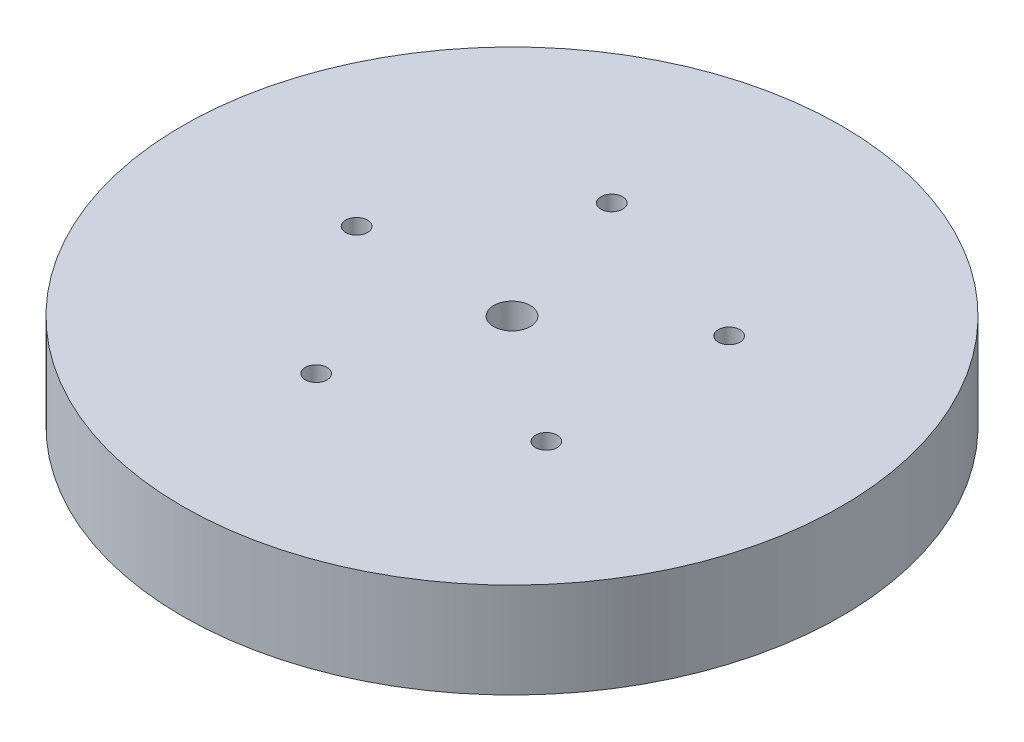
ISO-10303-21;
HEADER;
FILE_DESCRIPTION(('STEP AP214'),'2;1');
FILE_NAME('part.step','',(''),(''),'','','');
FILE_SCHEMA(('AUTOMOTIVE_DESIGN { 1 0 10303 214 1 1 1 1 }'));
ENDSEC;
DATA;
#1=APPLICATION_CONTEXT('core data for automotive mechanical design processes');
#2=APPLICATION_PROTOCOL_DEFINITION('international standard','automotive_design',2000,#1);
#3=PRODUCT_CONTEXT('',#1,'mechanical');
#4=PRODUCT('Part','Part','',(#3));
#5=PRODUCT_RELATED_PRODUCT_CATEGORY('part','',(#4));
#6=PRODUCT_DEFINITION_FORMATION('','',#4);
#7=PRODUCT_DEFINITION_CONTEXT('part definition',#1,'design');
#8=PRODUCT_DEFINITION('design','',#6,#7);
#9=PRODUCT_DEFINITION_SHAPE('','',#8);
#10=(LENGTH_UNIT() NAMED_UNIT(*) SI_UNIT(.MILLI.,.METRE.));
#11=(NAMED_UNIT(*) PLANE_ANGLE_UNIT() SI_UNIT($,.RADIAN.));
#12=(NAMED_UNIT(*) SI_UNIT($,.STERADIAN.) SOLID_ANGLE_UNIT());
#13=UNCERTAINTY_MEASURE_WITH_UNIT(LENGTH_MEASURE(1.E-05),#10,'distance_accuracy_value','');
#14=(GEOMETRIC_REPRESENTATION_CONTEXT(3) GLOBAL_UNCERTAINTY_ASSIGNED_CONTEXT((#13)) GLOBAL_UNIT_ASSIGNED_CONTEXT((#10,
#11,#12)) REPRESENTATION_CONTEXT('',''));
#15=CARTESIAN_POINT('',(0.,0.,0.));
#16=DIRECTION('',(0.,0.,1.));
#17=DIRECTION('',(1.,0.,0.));
#18=AXIS2_PLACEMENT_3D('',#15,#16,#17);
#19=CARTESIAN_POINT('',(0.,26.,0.));
#20=DIRECTION('',(0.,-1.,0.));
#21=DIRECTION('',(0.,0.,-1.));
#22=AXIS2_PLACEMENT_3D('',#19,#20,#21);
#23=CYLINDRICAL_SURFACE('',#22,90.);
#24=CARTESIAN_POINT('',(0.,26.,0.));
#25=DIRECTION('',(0.,1.,0.));
#26=DIRECTION('',(0.,0.,1.));
#27=AXIS2_PLACEMENT_3D('',#24,#25,#26);
#28=CIRCLE('',#27,90.);
#29=CARTESIAN_POINT('',(0.,26.,-90.));
#30=VERTEX_POINT('',#29);
#31=EDGE_CURVE('E10',#30,#30,#28,.T.);
#32=CARTESIAN_POINT('',(0.,0.,0.));
#33=DIRECTION('',(0.,1.,0.));
#34=DIRECTION('',(0.,0.,1.));
#35=AXIS2_PLACEMENT_3D('',#32,#33,#34);
#36=CIRCLE('',#35,90.);
#37=CARTESIAN_POINT('',(0.,0.,-90.));
#38=VERTEX_POINT('',#37);
#39=EDGE_CURVE('E37',#38,#38,#36,.T.);
#40=CARTESIAN_POINT('',(0.,26.,-90.));
#41=CARTESIAN_POINT('',(0.,25.7291666666667,-90.));
#42=CARTESIAN_POINT('',(0.,25.4583333333333,-90.));
#43=CARTESIAN_POINT('',(0.,24.9166666666667,-90.));
#44=CARTESIAN_POINT('',(0.,24.6458333333333,-90.));
#45=CARTESIAN_POINT('',(0.,24.1041666666667,-90.));
#46=CARTESIAN_POINT('',(0.,23.8333333333333,-90.));
#47=CARTESIAN_POINT('',(0.,23.2916666666667,-90.));
#48=CARTESIAN_POINT('',(0.,23.0208333333333,-90.));
#49=CARTESIAN_POINT('',(0.,22.4791666666667,-90.));
#50=CARTESIAN_POINT('',(0.,22.2083333333333,-90.));
#51=CARTESIAN_POINT('',(0.,21.6666666666667,-90.));
#52=CARTESIAN_POINT('',(0.,21.3958333333333,-90.));
#53=CARTESIAN_POINT('',(0.,20.8541666666667,-90.));
#54=CARTESIAN_POINT('',(0.,20.5833333333333,-90.));
#55=CARTESIAN_POINT('',(0.,20.0416666666667,-90.));
#56=CARTESIAN_POINT('',(0.,19.7708333333333,-90.));
#57=CARTESIAN_POINT('',(0.,19.2291666666667,-90.));
#58=CARTESIAN_POINT('',(0.,18.9583333333333,-90.));
#59=CARTESIAN_POINT('',(0.,18.4166666666667,-90.));
#60=CARTESIAN_POINT('',(0.,18.1458333333333,-90.));
#61=CARTESIAN_POINT('',(0.,17.6041666666667,-90.));
#62=CARTESIAN_POINT('',(0.,17.3333333333333,-90.));
#63=CARTESIAN_POINT('',(0.,16.7916666666667,-90.));
#64=CARTESIAN_POINT('',(0.,16.5208333333333,-90.));
#65=CARTESIAN_POINT('',(0.,15.9791666666667,-90.));
#66=CARTESIAN_POINT('',(0.,15.7083333333333,-90.));
#67=CARTESIAN_POINT('',(0.,15.1666666666667,-90.));
#68=CARTESIAN_POINT('',(0.,14.8958333333333,-90.));
#69=CARTESIAN_POINT('',(0.,14.3541666666667,-90.));
#70=CARTESIAN_POINT('',(0.,14.0833333333333,-90.));
#71=CARTESIAN_POINT('',(0.,13.5416666666667,-90.));
#72=CARTESIAN_POINT('',(0.,13.2708333333333,-90.));
#73=CARTESIAN_POINT('',(0.,12.7291666666667,-90.));
#74=CARTESIAN_POINT('',(0.,12.4583333333333,-90.));
#75=CARTESIAN_POINT('',(0.,11.9166666666667,-90.));
#76=CARTESIAN_POINT('',(0.,11.6458333333333,-90.));
#77=CARTESIAN_POINT('',(0.,11.1041666666667,-90.));
#78=CARTESIAN_POINT('',(0.,10.8333333333333,-90.));
#79=CARTESIAN_POINT('',(0.,10.2916666666667,-90.));
#80=CARTESIAN_POINT('',(0.,10.0208333333333,-90.));
#81=CARTESIAN_POINT('',(0.,9.47916666666667,-90.));
#82=CARTESIAN_POINT('',(0.,9.20833333333333,-90.));
#83=CARTESIAN_POINT('',(0.,8.66666666666667,-90.));
#84=CARTESIAN_POINT('',(0.,8.39583333333333,-90.));
#85=CARTESIAN_POINT('',(0.,7.85416666666667,-90.));
#86=CARTESIAN_POINT('',(0.,7.58333333333333,-90.));
#87=CARTESIAN_POINT('',(0.,7.04166666666667,-90.));
#88=CARTESIAN_POINT('',(0.,6.77083333333333,-90.));
#89=CARTESIAN_POINT('',(0.,6.22916666666667,-90.));
#90=CARTESIAN_POINT('',(0.,5.95833333333333,-90.));
#91=CARTESIAN_POINT('',(0.,5.41666666666667,-90.));
#92=CARTESIAN_POINT('',(0.,5.14583333333333,-90.));
#93=CARTESIAN_POINT('',(0.,4.60416666666667,-90.));
#94=CARTESIAN_POINT('',(0.,4.33333333333333,-90.));
#95=CARTESIAN_POINT('',(0.,3.79166666666667,-90.));
#96=CARTESIAN_POINT('',(0.,3.52083333333333,-90.));
#97=CARTESIAN_POINT('',(0.,2.97916666666667,-90.));
#98=CARTESIAN_POINT('',(0.,2.70833333333333,-90.));
#99=CARTESIAN_POINT('',(0.,2.16666666666667,-90.));
#100=CARTESIAN_POINT('',(0.,1.89583333333333,-90.));
#101=CARTESIAN_POINT('',(0.,1.35416666666667,-90.));
#102=CARTESIAN_POINT('',(0.,1.08333333333333,-90.));
#103=CARTESIAN_POINT('',(0.,0.541666666666667,-90.));
#104=CARTESIAN_POINT('',(0.,0.270833333333334,-90.));
#105=CARTESIAN_POINT('',(0.,0.,-90.));
#106=B_SPLINE_CURVE_WITH_KNOTS('',3,(#40,#41,#42,#43,#44,#45,#46,#47,#48,#49,#50,#51,#52,#53,
#54,#55,#56,#57,#58,#59,#60,#61,#62,#63,#64,#65,#66,#67,#68,#69,#70,#71,#72,#73,#74,#75,#76,#77,
#78,#79,#80,#81,#82,#83,#84,#85,#86,#87,#88,#89,#90,#91,#92,#93,#94,#95,#96,#97,#98,#99,#100,
#101,#102,#103,#104,#105),.UNSPECIFIED.,.F.,.F.,(4,2,2,2,2,2,2,2,2,2,2,2,2,2,2,2,2,2,2,2,2,2,2,
2,2,2,2,2,2,2,2,2,4),(0.,0.812500000000001,1.625,2.4375,3.25,4.0625,4.875,5.6875,6.5,7.3125,
8.125,8.9375,9.75,10.5625,11.375,12.1875,13.,13.8125,14.625,15.4375,16.25,17.0625,17.875,
18.6875,19.5,20.3125,21.125,21.9375,22.75,23.5625,24.375,25.1875,26.),.UNSPECIFIED.);
#107=EDGE_CURVE('BSEAM40',#30,#38,#106,.T.);
#108=ORIENTED_EDGE('',*,*,#31,.F.);
#109=ORIENTED_EDGE('',*,*,#39,.T.);
#110=ORIENTED_EDGE('',*,*,#107,.T.);
#111=ORIENTED_EDGE('',*,*,#107,.F.);
#112=EDGE_LOOP('',(#108,#110,#109,#111));
#113=FACE_BOUND('',#112,.T.);
#114=ADVANCED_FACE('F40',(#113),#23,.T.);
#115=CARTESIAN_POINT('',(0.,26.,0.));
#116=DIRECTION('',(0.,1.,0.));
#117=DIRECTION('',(0.,0.,1.));
#118=AXIS2_PLACEMENT_3D('',#115,#116,#117);
#119=PLANE('',#118);
#120=CARTESIAN_POINT('',(-13.1159711748449,26.,40.3668085588856));
#121=DIRECTION('',(0.,1.,0.));
#122=DIRECTION('',(0.951056516295155,0.,0.309016994374945));
#123=AXIS2_PLACEMENT_3D('',#120,#121,#122);
#124=CIRCLE('',#123,2.96772100061196);
#125=CARTESIAN_POINT('',(-10.2935007786669,26.,41.2838847826381));
#126=VERTEX_POINT('',#125);
#127=EDGE_CURVE('E78',#126,#126,#124,.T.);
#128=ORIENTED_EDGE('',*,*,#127,.F.);
#129=EDGE_LOOP('',(#128));
#130=FACE_BOUND('',#129,.T.);
#131=CARTESIAN_POINT('',(34.3380583312082,26.,24.9480597067512));
#132=DIRECTION('',(0.,1.,0.));
#133=DIRECTION('',(0.587785252292469,0.,-0.809016994374951));
#134=AXIS2_PLACEMENT_3D('',#131,#132,#133);
#135=CIRCLE('',#134,2.96772100061196);
#136=CARTESIAN_POINT('',(36.0824409682865,26.,22.5471229826927));
#137=VERTEX_POINT('',#136);
#138=EDGE_CURVE('E71',#137,#137,#135,.T.);
#139=ORIENTED_EDGE('',*,*,#138,.F.);
#140=EDGE_LOOP('',(#139));
#141=FACE_BOUND('',#140,.T.);
#142=CARTESIAN_POINT('',(34.3380583312078,26.,-24.9480597067517));
#143=DIRECTION('',(0.,1.,0.));
#144=DIRECTION('',(-0.58778525229248,0.,-0.809016994374942));
#145=AXIS2_PLACEMENT_3D('',#142,#143,#144);
#146=CIRCLE('',#145,2.96772100061196);
#147=CARTESIAN_POINT('',(32.5936756941294,26.,-27.3489964308102));
#148=VERTEX_POINT('',#147);
#149=EDGE_CURVE('E70',#148,#148,#146,.T.);
#150=ORIENTED_EDGE('',*,*,#149,.F.);
#151=EDGE_LOOP('',(#150));
#152=FACE_BOUND('',#151,.T.);
#153=CARTESIAN_POINT('',(-13.1159711748454,26.,-40.3668085588854));
#154=DIRECTION('',(0.,1.,0.));
#155=DIRECTION('',(-0.95105651629515,0.,0.309016994374958));
#156=AXIS2_PLACEMENT_3D('',#153,#154,#155);
#157=CIRCLE('',#156,2.96772100061196);
#158=CARTESIAN_POINT('',(-15.9384415710234,26.,-39.4497323351328));
#159=VERTEX_POINT('',#158);
#160=EDGE_CURVE('E61',#159,#159,#157,.T.);
#161=ORIENTED_EDGE('',*,*,#160,.F.);
#162=EDGE_LOOP('',(#161));
#163=FACE_BOUND('',#162,.T.);
#164=CARTESIAN_POINT('',(-42.4441743127261,26.,0.));
#165=DIRECTION('',(0.,1.,0.));
#166=DIRECTION('',(0.,0.,1.));
#167=AXIS2_PLACEMENT_3D('',#164,#165,#166);
#168=CIRCLE('',#167,2.96772100061196);
#169=CARTESIAN_POINT('',(-42.4441743127261,26.,2.96772100061196));
#170=VERTEX_POINT('',#169);
#171=EDGE_CURVE('E54',#170,#170,#168,.T.);
#172=ORIENTED_EDGE('',*,*,#171,.F.);
#173=EDGE_LOOP('',(#172));
#174=FACE_BOUND('',#173,.T.);
#175=CARTESIAN_POINT('',(0.,26.,0.));
#176=DIRECTION('',(0.,1.,0.));
#177=DIRECTION('',(0.,0.,1.));
#178=AXIS2_PLACEMENT_3D('',#175,#176,#177);
#179=CIRCLE('',#178,5.);
#180=CARTESIAN_POINT('',(0.,26.,-5.));
#181=VERTEX_POINT('',#180);
#182=EDGE_CURVE('E50',#181,#181,#179,.T.);
#183=ORIENTED_EDGE('',*,*,#182,.F.);
#184=EDGE_LOOP('',(#183));
#185=FACE_BOUND('',#184,.T.);
#186=ORIENTED_EDGE('',*,*,#31,.T.);
#187=EDGE_LOOP('',(#186));
#188=FACE_BOUND('',#187,.T.);
#189=ADVANCED_FACE('F94',(#130,#141,#152,#163,#174,#185,#188),#119,.T.);
#190=CARTESIAN_POINT('',(0.,0.,0.));
#191=DIRECTION('',(0.,1.,0.));
#192=DIRECTION('',(0.,0.,1.));
#193=AXIS2_PLACEMENT_3D('',#190,#191,#192);
#194=PLANE('',#193);
#195=CARTESIAN_POINT('',(0.,0.,0.));
#196=DIRECTION('',(0.,1.,0.));
#197=DIRECTION('',(0.,0.,1.));
#198=AXIS2_PLACEMENT_3D('',#195,#196,#197);
#199=CIRCLE('',#198,5.);
#200=CARTESIAN_POINT('',(0.,0.,-5.));
#201=VERTEX_POINT('',#200);
#202=EDGE_CURVE('E47',#201,#201,#199,.T.);
#203=ORIENTED_EDGE('',*,*,#202,.T.);
#204=EDGE_LOOP('',(#203));
#205=FACE_BOUND('',#204,.T.);
#206=ORIENTED_EDGE('',*,*,#39,.F.);
#207=EDGE_LOOP('',(#206));
#208=FACE_BOUND('',#207,.T.);
#209=ADVANCED_FACE('F100',(#205,#208),#194,.F.);
#210=CARTESIAN_POINT('',(0.,26.,0.));
#211=DIRECTION('',(0.,-1.,0.));
#212=DIRECTION('',(0.,0.,-1.));
#213=AXIS2_PLACEMENT_3D('',#210,#211,#212);
#214=CYLINDRICAL_SURFACE('',#213,5.);
#215=CARTESIAN_POINT('',(0.,26.,-5.));
#216=CARTESIAN_POINT('',(0.,25.7291666666667,-5.));
#217=CARTESIAN_POINT('',(0.,25.4583333333333,-5.));
#218=CARTESIAN_POINT('',(0.,24.9166666666667,-5.));
#219=CARTESIAN_POINT('',(0.,24.6458333333333,-5.));
#220=CARTESIAN_POINT('',(0.,24.1041666666667,-5.));
#221=CARTESIAN_POINT('',(0.,23.8333333333333,-5.));
#222=CARTESIAN_POINT('',(0.,23.2916666666667,-5.));
#223=CARTESIAN_POINT('',(0.,23.0208333333333,-5.));
#224=CARTESIAN_POINT('',(0.,22.4791666666667,-5.));
#225=CARTESIAN_POINT('',(0.,22.2083333333333,-5.));
#226=CARTESIAN_POINT('',(0.,21.6666666666667,-5.));
#227=CARTESIAN_POINT('',(0.,21.3958333333333,-5.));
#228=CARTESIAN_POINT('',(0.,20.8541666666667,-5.));
#229=CARTESIAN_POINT('',(0.,20.5833333333333,-5.));
#230=CARTESIAN_POINT('',(0.,20.0416666666667,-5.));
#231=CARTESIAN_POINT('',(0.,19.7708333333333,-5.));
#232=CARTESIAN_POINT('',(0.,19.2291666666667,-5.));
#233=CARTESIAN_POINT('',(0.,18.9583333333333,-5.));
#234=CARTESIAN_POINT('',(0.,18.4166666666667,-5.));
#235=CARTESIAN_POINT('',(0.,18.1458333333333,-5.));
#236=CARTESIAN_POINT('',(0.,17.6041666666667,-5.));
#237=CARTESIAN_POINT('',(0.,17.3333333333333,-5.));
#238=CARTESIAN_POINT('',(0.,16.7916666666667,-5.));
#239=CARTESIAN_POINT('',(0.,16.5208333333333,-5.));
#240=CARTESIAN_POINT('',(0.,15.9791666666667,-5.));
#241=CARTESIAN_POINT('',(0.,15.7083333333333,-5.));
#242=CARTESIAN_POINT('',(0.,15.1666666666667,-5.));
#243=CARTESIAN_POINT('',(0.,14.8958333333333,-5.));
#244=CARTESIAN_POINT('',(0.,14.3541666666667,-5.));
#245=CARTESIAN_POINT('',(0.,14.0833333333333,-5.));
#246=CARTESIAN_POINT('',(0.,13.5416666666667,-5.));
#247=CARTESIAN_POINT('',(0.,13.2708333333333,-5.));
#248=CARTESIAN_POINT('',(0.,12.7291666666667,-5.));
#249=CARTESIAN_POINT('',(0.,12.4583333333333,-5.));
#250=CARTESIAN_POINT('',(0.,11.9166666666667,-5.));
#251=CARTESIAN_POINT('',(0.,11.6458333333333,-5.));
#252=CARTESIAN_POINT('',(0.,11.1041666666667,-5.));
#253=CARTESIAN_POINT('',(0.,10.8333333333333,-5.));
#254=CARTESIAN_POINT('',(0.,10.2916666666667,-5.));
#255=CARTESIAN_POINT('',(0.,10.0208333333333,-5.));
#256=CARTESIAN_POINT('',(0.,9.47916666666667,-5.));
#257=CARTESIAN_POINT('',(0.,9.20833333333333,-5.));
#258=CARTESIAN_POINT('',(0.,8.66666666666667,-5.));
#259=CARTESIAN_POINT('',(0.,8.39583333333333,-5.));
#260=CARTESIAN_POINT('',(0.,7.85416666666667,-5.));
#261=CARTESIAN_POINT('',(0.,7.58333333333333,-5.));
#262=CARTESIAN_POINT('',(0.,7.04166666666667,-5.));
#263=CARTESIAN_POINT('',(0.,6.77083333333333,-5.));
#264=CARTESIAN_POINT('',(0.,6.22916666666667,-5.));
#265=CARTESIAN_POINT('',(0.,5.95833333333333,-5.));
#266=CARTESIAN_POINT('',(0.,5.41666666666667,-5.));
#267=CARTESIAN_POINT('',(0.,5.14583333333333,-5.));
#268=CARTESIAN_POINT('',(0.,4.60416666666667,-5.));
#269=CARTESIAN_POINT('',(0.,4.33333333333333,-5.));
#270=CARTESIAN_POINT('',(0.,3.79166666666667,-5.));
#271=CARTESIAN_POINT('',(0.,3.52083333333333,-5.));
#272=CARTESIAN_POINT('',(0.,2.97916666666667,-5.));
#273=CARTESIAN_POINT('',(0.,2.70833333333333,-5.));
#274=CARTESIAN_POINT('',(0.,2.16666666666667,-5.));
#275=CARTESIAN_POINT('',(0.,1.89583333333333,-5.));
#276=CARTESIAN_POINT('',(0.,1.35416666666667,-5.));
#277=CARTESIAN_POINT('',(0.,1.08333333333333,-5.));
#278=CARTESIAN_POINT('',(0.,0.541666666666667,-5.));
#279=CARTESIAN_POINT('',(0.,0.270833333333334,-5.));
#280=CARTESIAN_POINT('',(0.,0.,-5.));
#281=B_SPLINE_CURVE_WITH_KNOTS('',3,(#215,#216,#217,#218,#219,#220,#221,#222,#223,#224,#225,
#226,#227,#228,#229,#230,#231,#232,#233,#234,#235,#236,#237,#238,#239,#240,#241,#242,#243,#244,
#245,#246,#247,#248,#249,#250,#251,#252,#253,#254,#255,#256,#257,#258,#259,#260,#261,#262,#263,
#264,#265,#266,#267,#268,#269,#270,#271,#272,#273,#274,#275,#276,#277,#278,#279,#280),
.UNSPECIFIED.,.F.,.F.,(4,2,2,2,2,2,2,2,2,2,2,2,2,2,2,2,2,2,2,2,2,2,2,2,2,2,2,2,2,2,2,2,4),(0.,
0.812499999999997,1.625,2.4375,3.25,4.0625,4.875,5.6875,6.5,7.3125,8.125,8.93749999999999,
9.74999999999999,10.5625,11.375,12.1875,13.,13.8125,14.625,15.4375,16.25,17.0625,17.875,18.6875,
19.5,20.3125,21.125,21.9375,22.75,23.5625,24.375,25.1875,26.),.UNSPECIFIED.);
#282=EDGE_CURVE('BSEAM108',#181,#201,#281,.T.);
#283=ORIENTED_EDGE('',*,*,#182,.T.);
#284=ORIENTED_EDGE('',*,*,#202,.F.);
#285=ORIENTED_EDGE('',*,*,#282,.T.);
#286=ORIENTED_EDGE('',*,*,#282,.F.);
#287=EDGE_LOOP('',(#283,#285,#284,#286));
#288=FACE_BOUND('',#287,.T.);
#289=ADVANCED_FACE('F108',(#288),#214,.F.);
#290=CARTESIAN_POINT('',(-42.4441743127261,4.5095070391711,0.));
#291=DIRECTION('',(0.,1.,0.));
#292=DIRECTION('',(0.,0.,1.));
#293=AXIS2_PLACEMENT_3D('',#290,#291,#292);
#294=CYLINDRICAL_SURFACE('',#293,2.96772100061196);
#295=CARTESIAN_POINT('',(-42.4441743127261,4.5095070391711,0.));
#296=DIRECTION('',(0.,1.,0.));
#297=DIRECTION('',(0.,0.,1.));
#298=AXIS2_PLACEMENT_3D('',#295,#296,#297);
#299=CIRCLE('',#298,2.96772100061196);
#300=CARTESIAN_POINT('',(-42.4441743127261,4.5095070391711,2.96772100061196));
#301=VERTEX_POINT('',#300);
#302=EDGE_CURVE('E55',#301,#301,#299,.T.);
#303=ORIENTED_EDGE('',*,*,#302,.F.);
#304=EDGE_LOOP('',(#303));
#305=FACE_BOUND('',#304,.T.);
#306=ORIENTED_EDGE('',*,*,#171,.T.);
#307=EDGE_LOOP('',(#306));
#308=FACE_BOUND('',#307,.T.);
#309=ADVANCED_FACE('F115',(#305,#308),#294,.F.);
#310=CARTESIAN_POINT('',(-42.4441743127261,4.5095070391711,0.));
#311=DIRECTION('',(0.,1.,0.));
#312=DIRECTION('',(0.,0.,1.));
#313=AXIS2_PLACEMENT_3D('',#310,#311,#312);
#314=PLANE('',#313);
#315=ORIENTED_EDGE('',*,*,#302,.T.);
#316=EDGE_LOOP('',(#315));
#317=FACE_BOUND('',#316,.T.);
#318=ADVANCED_FACE('F142',(#317),#314,.T.);
#319=CARTESIAN_POINT('',(-13.1159711748454,4.5095070391711,-40.3668085588854));
#320=DIRECTION('',(0.,1.,0.));
#321=DIRECTION('',(0.,0.,1.));
#322=AXIS2_PLACEMENT_3D('',#319,#320,#321);
#323=CYLINDRICAL_SURFACE('',#322,2.96772100061196);
#324=CARTESIAN_POINT('',(-13.1159711748454,4.5095070391711,-40.3668085588854));
#325=DIRECTION('',(0.,1.,0.));
#326=DIRECTION('',(-0.95105651629515,0.,0.309016994374958));
#327=AXIS2_PLACEMENT_3D('',#324,#325,#326);
#328=CIRCLE('',#327,2.96772100061196);
#329=CARTESIAN_POINT('',(-15.9384415710234,4.5095070391711,-39.4497323351328));
#330=VERTEX_POINT('',#329);
#331=EDGE_CURVE('E63',#330,#330,#328,.T.);
#332=ORIENTED_EDGE('',*,*,#331,.F.);
#333=EDGE_LOOP('',(#332));
#334=FACE_BOUND('',#333,.T.);
#335=ORIENTED_EDGE('',*,*,#160,.T.);
#336=EDGE_LOOP('',(#335));
#337=FACE_BOUND('',#336,.T.);
#338=ADVANCED_FACE('F147',(#334,#337),#323,.F.);
#339=CARTESIAN_POINT('',(-13.1159711748454,4.5095070391711,-40.3668085588854));
#340=DIRECTION('',(0.,1.,0.));
#341=DIRECTION('',(-0.95105651629515,0.,0.309016994374958));
#342=AXIS2_PLACEMENT_3D('',#339,#340,#341);
#343=PLANE('',#342);
#344=ORIENTED_EDGE('',*,*,#331,.T.);
#345=EDGE_LOOP('',(#344));
#346=FACE_BOUND('',#345,.T.);
#347=ADVANCED_FACE('F163',(#346),#343,.T.);
#348=CARTESIAN_POINT('',(34.3380583312078,4.5095070391711,-24.9480597067517));
#349=DIRECTION('',(0.,1.,0.));
#350=DIRECTION('',(0.,0.,1.));
#351=AXIS2_PLACEMENT_3D('',#348,#349,#350);
#352=CYLINDRICAL_SURFACE('',#351,2.96772100061196);
#353=CARTESIAN_POINT('',(34.3380583312078,4.5095070391711,-24.9480597067517));
#354=DIRECTION('',(0.,1.,0.));
#355=DIRECTION('',(-0.58778525229248,0.,-0.809016994374942));
#356=AXIS2_PLACEMENT_3D('',#353,#354,#355);
#357=CIRCLE('',#356,2.96772100061196);
#358=CARTESIAN_POINT('',(32.5936756941294,4.5095070391711,-27.3489964308102));
#359=VERTEX_POINT('',#358);
#360=EDGE_CURVE('E69',#359,#359,#357,.T.);
#361=ORIENTED_EDGE('',*,*,#360,.F.);
#362=EDGE_LOOP('',(#361));
#363=FACE_BOUND('',#362,.T.);
#364=ORIENTED_EDGE('',*,*,#149,.T.);
#365=EDGE_LOOP('',(#364));
#366=FACE_BOUND('',#365,.T.);
#367=ADVANCED_FACE('F172',(#363,#366),#352,.F.);
#368=CARTESIAN_POINT('',(34.3380583312078,4.5095070391711,-24.9480597067517));
#369=DIRECTION('',(0.,1.,0.));
#370=DIRECTION('',(-0.58778525229248,0.,-0.809016994374942));
#371=AXIS2_PLACEMENT_3D('',#368,#369,#370);
#372=PLANE('',#371);
#373=ORIENTED_EDGE('',*,*,#360,.T.);
#374=EDGE_LOOP('',(#373));
#375=FACE_BOUND('',#374,.T.);
#376=ADVANCED_FACE('F185',(#375),#372,.T.);
#377=CARTESIAN_POINT('',(34.3380583312082,4.5095070391711,24.9480597067512));
#378=DIRECTION('',(0.,1.,0.));
#379=DIRECTION('',(0.,0.,1.));
#380=AXIS2_PLACEMENT_3D('',#377,#378,#379);
#381=CYLINDRICAL_SURFACE('',#380,2.96772100061196);
#382=CARTESIAN_POINT('',(34.3380583312082,4.5095070391711,24.9480597067512));
#383=DIRECTION('',(0.,1.,0.));
#384=DIRECTION('',(0.587785252292469,0.,-0.809016994374951));
#385=AXIS2_PLACEMENT_3D('',#382,#383,#384);
#386=CIRCLE('',#385,2.96772100061196);
#387=CARTESIAN_POINT('',(36.0824409682865,4.5095070391711,22.5471229826927));
#388=VERTEX_POINT('',#387);
#389=EDGE_CURVE('E76',#388,#388,#386,.T.);
#390=ORIENTED_EDGE('',*,*,#389,.F.);
#391=EDGE_LOOP('',(#390));
#392=FACE_BOUND('',#391,.T.);
#393=ORIENTED_EDGE('',*,*,#138,.T.);
#394=EDGE_LOOP('',(#393));
#395=FACE_BOUND('',#394,.T.);
#396=ADVANCED_FACE('F191',(#392,#395),#381,.F.);
#397=CARTESIAN_POINT('',(34.3380583312082,4.5095070391711,24.9480597067512));
#398=DIRECTION('',(0.,1.,0.));
#399=DIRECTION('',(0.587785252292469,0.,-0.809016994374951));
#400=AXIS2_PLACEMENT_3D('',#397,#398,#399);
#401=PLANE('',#400);
#402=ORIENTED_EDGE('',*,*,#389,.T.);
#403=EDGE_LOOP('',(#402));
#404=FACE_BOUND('',#403,.T.);
#405=ADVANCED_FACE('F89',(#404),#401,.T.);
#406=CARTESIAN_POINT('',(-13.1159711748449,4.5095070391711,40.3668085588856));
#407=DIRECTION('',(0.,1.,0.));
#408=DIRECTION('',(0.,0.,1.));
#409=AXIS2_PLACEMENT_3D('',#406,#407,#408);
#410=CYLINDRICAL_SURFACE('',#409,2.96772100061196);
#411=CARTESIAN_POINT('',(-13.1159711748449,4.5095070391711,40.3668085588856));
#412=DIRECTION('',(0.,1.,0.));
#413=DIRECTION('',(0.951056516295155,0.,0.309016994374945));
#414=AXIS2_PLACEMENT_3D('',#411,#412,#413);
#415=CIRCLE('',#414,2.96772100061196);
#416=CARTESIAN_POINT('',(-10.2935007786669,4.5095070391711,41.2838847826381));
#417=VERTEX_POINT('',#416);
#418=EDGE_CURVE('E59',#417,#417,#415,.T.);
#419=ORIENTED_EDGE('',*,*,#418,.F.);
#420=EDGE_LOOP('',(#419));
#421=FACE_BOUND('',#420,.T.);
#422=ORIENTED_EDGE('',*,*,#127,.T.);
#423=EDGE_LOOP('',(#422));
#424=FACE_BOUND('',#423,.T.);
#425=ADVANCED_FACE('F87',(#421,#424),#410,.F.);
#426=CARTESIAN_POINT('',(-13.1159711748449,4.5095070391711,40.3668085588856));
#427=DIRECTION('',(0.,1.,0.));
#428=DIRECTION('',(0.951056516295155,0.,0.309016994374945));
#429=AXIS2_PLACEMENT_3D('',#426,#427,#428);
#430=PLANE('',#429);
#431=ORIENTED_EDGE('',*,*,#418,.T.);
#432=EDGE_LOOP('',(#431));
#433=FACE_BOUND('',#432,.T.);
#434=ADVANCED_FACE('F84',(#433),#430,.T.);
#435=CLOSED_SHELL('',(#114,#189,#209,#289,#309,#318,#338,#347,#367,#376,#396,#405,#425,#434));
#436=MANIFOLD_SOLID_BREP('B2',#435);
#437=ADVANCED_BREP_SHAPE_REPRESENTATION('',(#18,#436),#14);
#438=SHAPE_DEFINITION_REPRESENTATION(#9,#437);
ENDSEC;
END-ISO-10303-21;
